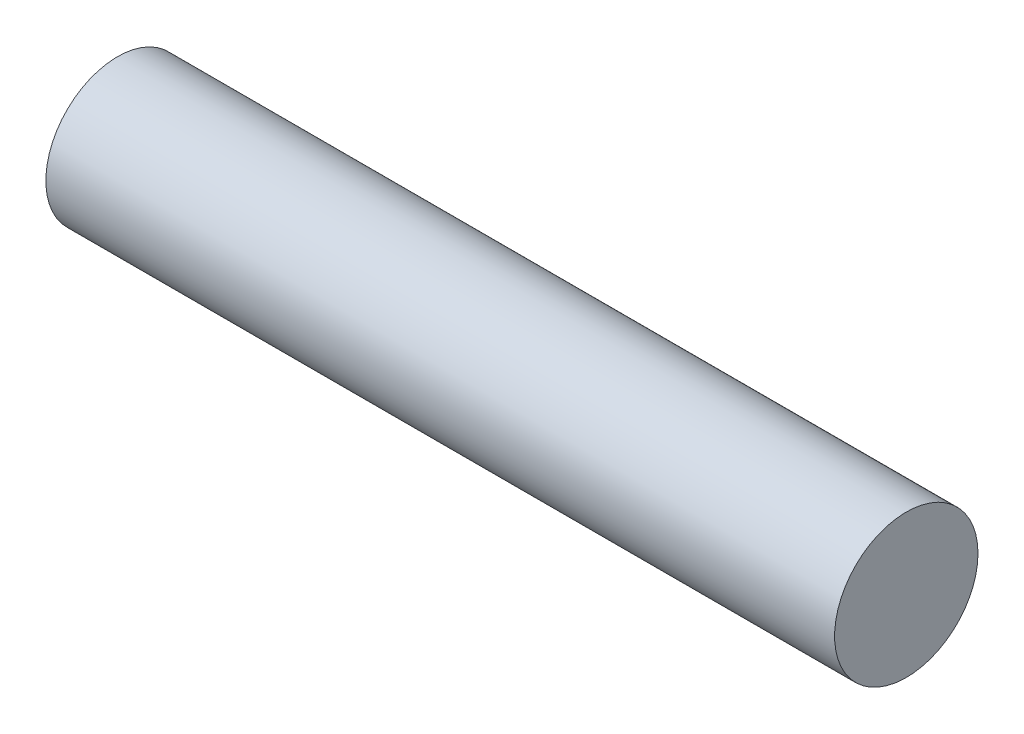
ISO-10303-21;
HEADER;
FILE_DESCRIPTION(('STEP AP214'),'2;1');
FILE_NAME('part.step','',(''),(''),'','','');
FILE_SCHEMA(('AUTOMOTIVE_DESIGN { 1 0 10303 214 1 1 1 1 }'));
ENDSEC;
DATA;
#1=APPLICATION_CONTEXT('core data for automotive mechanical design processes');
#2=APPLICATION_PROTOCOL_DEFINITION('international standard','automotive_design',2000,#1);
#3=PRODUCT_CONTEXT('',#1,'mechanical');
#4=PRODUCT('Part','Part','',(#3));
#5=PRODUCT_RELATED_PRODUCT_CATEGORY('part','',(#4));
#6=PRODUCT_DEFINITION_FORMATION('','',#4);
#7=PRODUCT_DEFINITION_CONTEXT('part definition',#1,'design');
#8=PRODUCT_DEFINITION('design','',#6,#7);
#9=PRODUCT_DEFINITION_SHAPE('','',#8);
#10=(LENGTH_UNIT() NAMED_UNIT(*) SI_UNIT(.MILLI.,.METRE.));
#11=(NAMED_UNIT(*) PLANE_ANGLE_UNIT() SI_UNIT($,.RADIAN.));
#12=(NAMED_UNIT(*) SI_UNIT($,.STERADIAN.) SOLID_ANGLE_UNIT());
#13=UNCERTAINTY_MEASURE_WITH_UNIT(LENGTH_MEASURE(1.E-05),#10,'distance_accuracy_value','');
#14=(GEOMETRIC_REPRESENTATION_CONTEXT(3) GLOBAL_UNCERTAINTY_ASSIGNED_CONTEXT((#13)) GLOBAL_UNIT_ASSIGNED_CONTEXT((#10,
#11,#12)) REPRESENTATION_CONTEXT('',''));
#15=CARTESIAN_POINT('',(0.,0.,0.));
#16=DIRECTION('',(0.,0.,1.));
#17=DIRECTION('',(1.,0.,0.));
#18=AXIS2_PLACEMENT_3D('',#15,#16,#17);
#19=CARTESIAN_POINT('',(16.5,0.,0.));
#20=DIRECTION('',(-1.,0.,0.));
#21=DIRECTION('',(0.,0.,1.));
#22=AXIS2_PLACEMENT_3D('',#19,#20,#21);
#23=CYLINDRICAL_SURFACE('',#22,1.5);
#24=CARTESIAN_POINT('',(16.5,0.,0.));
#25=DIRECTION('',(1.,0.,0.));
#26=DIRECTION('',(0.,0.,-1.));
#27=AXIS2_PLACEMENT_3D('',#24,#25,#26);
#28=CIRCLE('',#27,1.5);
#29=CARTESIAN_POINT('',(16.5,0.,-1.5));
#30=VERTEX_POINT('',#29);
#31=EDGE_CURVE('E10',#30,#30,#28,.T.);
#32=ORIENTED_EDGE('',*,*,#31,.F.);
#33=EDGE_LOOP('',(#32));
#34=FACE_BOUND('',#33,.T.);
#35=CARTESIAN_POINT('',(0.,0.,0.));
#36=DIRECTION('',(1.,0.,0.));
#37=DIRECTION('',(0.,0.,-1.));
#38=AXIS2_PLACEMENT_3D('',#35,#36,#37);
#39=CIRCLE('',#38,1.5);
#40=CARTESIAN_POINT('',(0.,0.,-1.5));
#41=VERTEX_POINT('',#40);
#42=EDGE_CURVE('E34',#41,#41,#39,.T.);
#43=ORIENTED_EDGE('',*,*,#42,.T.);
#44=EDGE_LOOP('',(#43));
#45=FACE_BOUND('',#44,.T.);
#46=ADVANCED_FACE('F31',(#34,#45),#23,.T.);
#47=CARTESIAN_POINT('',(16.5,0.,0.));
#48=DIRECTION('',(1.,0.,0.));
#49=DIRECTION('',(0.,0.,-1.));
#50=AXIS2_PLACEMENT_3D('',#47,#48,#49);
#51=PLANE('',#50);
#52=ORIENTED_EDGE('',*,*,#31,.T.);
#53=EDGE_LOOP('',(#52));
#54=FACE_BOUND('',#53,.T.);
#55=ADVANCED_FACE('F46',(#54),#51,.T.);
#56=CARTESIAN_POINT('',(0.,0.,0.));
#57=DIRECTION('',(1.,0.,0.));
#58=DIRECTION('',(0.,0.,-1.));
#59=AXIS2_PLACEMENT_3D('',#56,#57,#58);
#60=PLANE('',#59);
#61=ORIENTED_EDGE('',*,*,#42,.F.);
#62=EDGE_LOOP('',(#61));
#63=FACE_BOUND('',#62,.T.);
#64=ADVANCED_FACE('F44',(#63),#60,.F.);
#65=CLOSED_SHELL('',(#46,#55,#64));
#66=MANIFOLD_SOLID_BREP('B2',#65);
#67=ADVANCED_BREP_SHAPE_REPRESENTATION('',(#18,#66),#14);
#68=SHAPE_DEFINITION_REPRESENTATION(#9,#67);
ENDSEC;
END-ISO-10303-21;
